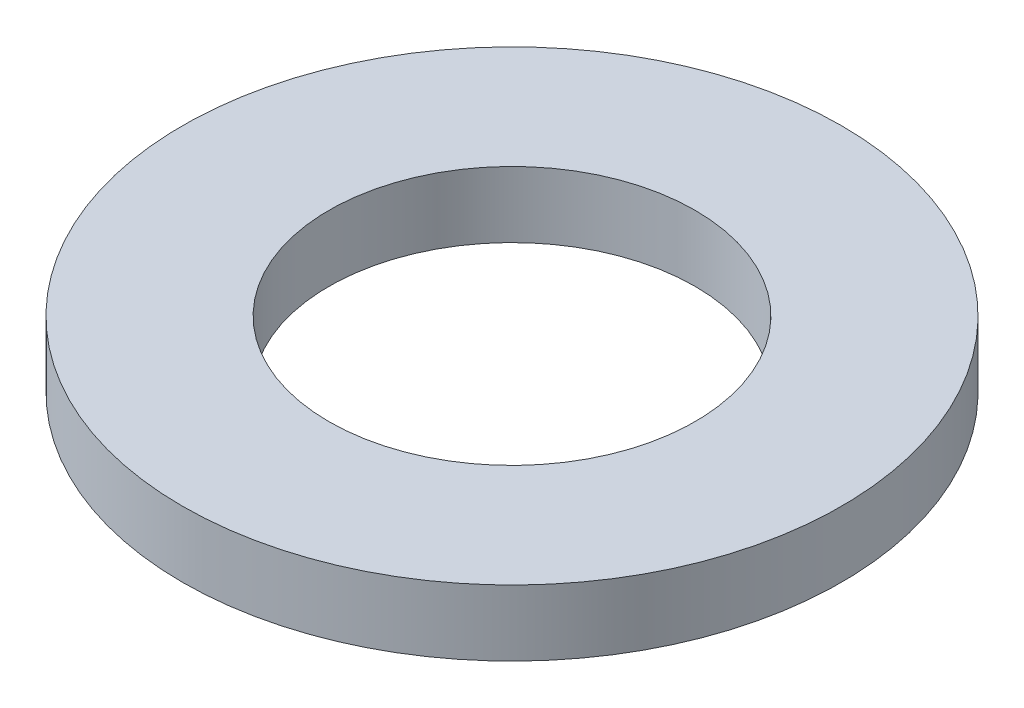
ISO-10303-21;
HEADER;
FILE_DESCRIPTION(('STEP AP214'),'2;1');
FILE_NAME('part.step','',(''),(''),'','','');
FILE_SCHEMA(('AUTOMOTIVE_DESIGN { 1 0 10303 214 1 1 1 1 }'));
ENDSEC;
DATA;
#1=APPLICATION_CONTEXT('core data for automotive mechanical design processes');
#2=APPLICATION_PROTOCOL_DEFINITION('international standard','automotive_design',2000,#1);
#3=PRODUCT_CONTEXT('',#1,'mechanical');
#4=PRODUCT('Part','Part','',(#3));
#5=PRODUCT_RELATED_PRODUCT_CATEGORY('part','',(#4));
#6=PRODUCT_DEFINITION_FORMATION('','',#4);
#7=PRODUCT_DEFINITION_CONTEXT('part definition',#1,'design');
#8=PRODUCT_DEFINITION('design','',#6,#7);
#9=PRODUCT_DEFINITION_SHAPE('','',#8);
#10=(LENGTH_UNIT() NAMED_UNIT(*) SI_UNIT(.MILLI.,.METRE.));
#11=(NAMED_UNIT(*) PLANE_ANGLE_UNIT() SI_UNIT($,.RADIAN.));
#12=(NAMED_UNIT(*) SI_UNIT($,.STERADIAN.) SOLID_ANGLE_UNIT());
#13=UNCERTAINTY_MEASURE_WITH_UNIT(LENGTH_MEASURE(1.E-05),#10,'distance_accuracy_value','');
#14=(GEOMETRIC_REPRESENTATION_CONTEXT(3) GLOBAL_UNCERTAINTY_ASSIGNED_CONTEXT((#13)) GLOBAL_UNIT_ASSIGNED_CONTEXT((#10,
#11,#12)) REPRESENTATION_CONTEXT('',''));
#15=CARTESIAN_POINT('',(0.,0.,0.));
#16=DIRECTION('',(0.,0.,1.));
#17=DIRECTION('',(1.,0.,0.));
#18=AXIS2_PLACEMENT_3D('',#15,#16,#17);
#19=CARTESIAN_POINT('',(0.,18.,0.));
#20=DIRECTION('',(0.,-1.,0.));
#21=DIRECTION('',(0.,0.,-1.));
#22=AXIS2_PLACEMENT_3D('',#19,#20,#21);
#23=CYLINDRICAL_SURFACE('',#22,90.);
#24=CARTESIAN_POINT('',(0.,18.,0.));
#25=DIRECTION('',(0.,1.,0.));
#26=DIRECTION('',(0.,0.,1.));
#27=AXIS2_PLACEMENT_3D('',#24,#25,#26);
#28=CIRCLE('',#27,90.);
#29=CARTESIAN_POINT('',(0.,18.,90.));
#30=VERTEX_POINT('',#29);
#31=EDGE_CURVE('E10',#30,#30,#28,.T.);
#32=ORIENTED_EDGE('',*,*,#31,.F.);
#33=EDGE_LOOP('',(#32));
#34=FACE_BOUND('',#33,.T.);
#35=CARTESIAN_POINT('',(0.,0.,0.));
#36=DIRECTION('',(0.,1.,0.));
#37=DIRECTION('',(0.,0.,1.));
#38=AXIS2_PLACEMENT_3D('',#35,#36,#37);
#39=CIRCLE('',#38,90.);
#40=CARTESIAN_POINT('',(0.,0.,90.));
#41=VERTEX_POINT('',#40);
#42=EDGE_CURVE('E37',#41,#41,#39,.T.);
#43=ORIENTED_EDGE('',*,*,#42,.T.);
#44=EDGE_LOOP('',(#43));
#45=FACE_BOUND('',#44,.T.);
#46=ADVANCED_FACE('F40',(#34,#45),#23,.T.);
#47=CARTESIAN_POINT('',(0.,18.,0.));
#48=DIRECTION('',(0.,1.,0.));
#49=DIRECTION('',(0.,0.,1.));
#50=AXIS2_PLACEMENT_3D('',#47,#48,#49);
#51=PLANE('',#50);
#52=CARTESIAN_POINT('',(0.,18.,0.));
#53=DIRECTION('',(0.,1.,0.));
#54=DIRECTION('',(0.,0.,1.));
#55=AXIS2_PLACEMENT_3D('',#52,#53,#54);
#56=CIRCLE('',#55,50.);
#57=CARTESIAN_POINT('',(0.,18.,50.));
#58=VERTEX_POINT('',#57);
#59=EDGE_CURVE('E50',#58,#58,#56,.T.);
#60=ORIENTED_EDGE('',*,*,#59,.F.);
#61=EDGE_LOOP('',(#60));
#62=FACE_BOUND('',#61,.T.);
#63=ORIENTED_EDGE('',*,*,#31,.T.);
#64=EDGE_LOOP('',(#63));
#65=FACE_BOUND('',#64,.T.);
#66=ADVANCED_FACE('F59',(#62,#65),#51,.T.);
#67=CARTESIAN_POINT('',(0.,0.,0.));
#68=DIRECTION('',(0.,1.,0.));
#69=DIRECTION('',(0.,0.,1.));
#70=AXIS2_PLACEMENT_3D('',#67,#68,#69);
#71=PLANE('',#70);
#72=CARTESIAN_POINT('',(0.,0.,0.));
#73=DIRECTION('',(0.,1.,0.));
#74=DIRECTION('',(0.,0.,1.));
#75=AXIS2_PLACEMENT_3D('',#72,#73,#74);
#76=CIRCLE('',#75,50.);
#77=CARTESIAN_POINT('',(0.,0.,50.));
#78=VERTEX_POINT('',#77);
#79=EDGE_CURVE('E47',#78,#78,#76,.T.);
#80=ORIENTED_EDGE('',*,*,#79,.T.);
#81=EDGE_LOOP('',(#80));
#82=FACE_BOUND('',#81,.T.);
#83=ORIENTED_EDGE('',*,*,#42,.F.);
#84=EDGE_LOOP('',(#83));
#85=FACE_BOUND('',#84,.T.);
#86=ADVANCED_FACE('F58',(#82,#85),#71,.F.);
#87=CARTESIAN_POINT('',(0.,18.,0.));
#88=DIRECTION('',(0.,-1.,0.));
#89=DIRECTION('',(0.,0.,-1.));
#90=AXIS2_PLACEMENT_3D('',#87,#88,#89);
#91=CYLINDRICAL_SURFACE('',#90,50.);
#92=ORIENTED_EDGE('',*,*,#59,.T.);
#93=EDGE_LOOP('',(#92));
#94=FACE_BOUND('',#93,.T.);
#95=ORIENTED_EDGE('',*,*,#79,.F.);
#96=EDGE_LOOP('',(#95));
#97=FACE_BOUND('',#96,.T.);
#98=ADVANCED_FACE('F54',(#94,#97),#91,.F.);
#99=CLOSED_SHELL('',(#46,#66,#86,#98));
#100=MANIFOLD_SOLID_BREP('B2',#99);
#101=ADVANCED_BREP_SHAPE_REPRESENTATION('',(#18,#100),#14);
#102=SHAPE_DEFINITION_REPRESENTATION(#9,#101);
ENDSEC;
END-ISO-10303-21;
